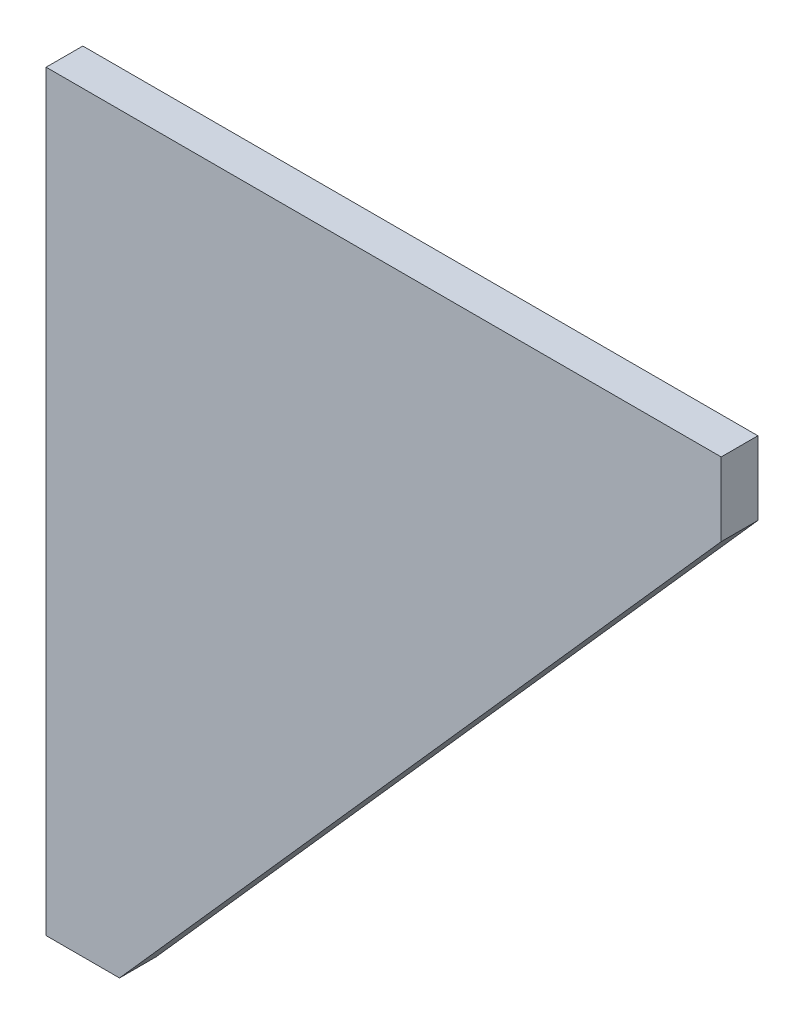
ISO-10303-21;
HEADER;
FILE_DESCRIPTION(('STEP AP214'),'2;1');
FILE_NAME('part.step','',(''),(''),'','','');
FILE_SCHEMA(('AUTOMOTIVE_DESIGN { 1 0 10303 214 1 1 1 1 }'));
ENDSEC;
DATA;
#1=APPLICATION_CONTEXT('core data for automotive mechanical design processes');
#2=APPLICATION_PROTOCOL_DEFINITION('international standard','automotive_design',2000,#1);
#3=PRODUCT_CONTEXT('',#1,'mechanical');
#4=PRODUCT('Part','Part','',(#3));
#5=PRODUCT_RELATED_PRODUCT_CATEGORY('part','',(#4));
#6=PRODUCT_DEFINITION_FORMATION('','',#4);
#7=PRODUCT_DEFINITION_CONTEXT('part definition',#1,'design');
#8=PRODUCT_DEFINITION('design','',#6,#7);
#9=PRODUCT_DEFINITION_SHAPE('','',#8);
#10=(LENGTH_UNIT() NAMED_UNIT(*) SI_UNIT(.MILLI.,.METRE.));
#11=(NAMED_UNIT(*) PLANE_ANGLE_UNIT() SI_UNIT($,.RADIAN.));
#12=(NAMED_UNIT(*) SI_UNIT($,.STERADIAN.) SOLID_ANGLE_UNIT());
#13=UNCERTAINTY_MEASURE_WITH_UNIT(LENGTH_MEASURE(1.E-05),#10,'distance_accuracy_value','');
#14=(GEOMETRIC_REPRESENTATION_CONTEXT(3) GLOBAL_UNCERTAINTY_ASSIGNED_CONTEXT((#13)) GLOBAL_UNIT_ASSIGNED_CONTEXT((#10,
#11,#12)) REPRESENTATION_CONTEXT('',''));
#15=CARTESIAN_POINT('',(0.,0.,0.));
#16=DIRECTION('',(0.,0.,1.));
#17=DIRECTION('',(1.,0.,0.));
#18=AXIS2_PLACEMENT_3D('',#15,#16,#17);
#19=CARTESIAN_POINT('',(92.,-10.,2.5));
#20=DIRECTION('',(-0.748301305404949,0.663358995061685,0.));
#21=DIRECTION('',(0.663358995061685,0.748301305404949,0.));
#22=AXIS2_PLACEMENT_3D('',#19,#20,#21);
#23=PLANE('',#22);
#24=DIRECTION('',(0.,0.,1.));
#25=VECTOR('',#24,1.);
#26=CARTESIAN_POINT('',(10.,-102.5,2.5));
#27=LINE('',#26,#25);
#28=CARTESIAN_POINT('',(10.,-102.5,-2.5));
#29=VERTEX_POINT('',#28);
#30=CARTESIAN_POINT('',(10.,-102.5,2.5));
#31=VERTEX_POINT('',#30);
#32=EDGE_CURVE('E11',#29,#31,#27,.T.);
#33=ORIENTED_EDGE('',*,*,#32,.F.);
#34=DIRECTION('',(0.663358995061685,0.748301305404949,0.));
#35=VECTOR('',#34,1.);
#36=CARTESIAN_POINT('',(92.,-10.,-2.5));
#37=LINE('',#36,#35);
#38=CARTESIAN_POINT('',(92.,-10.,-2.5));
#39=VERTEX_POINT('',#38);
#40=EDGE_CURVE('E94',#29,#39,#37,.T.);
#41=ORIENTED_EDGE('',*,*,#40,.T.);
#42=DIRECTION('',(0.,0.,1.));
#43=VECTOR('',#42,1.);
#44=CARTESIAN_POINT('',(92.,-10.,2.5));
#45=LINE('',#44,#43);
#46=CARTESIAN_POINT('',(92.,-10.,2.5));
#47=VERTEX_POINT('',#46);
#48=EDGE_CURVE('E46',#39,#47,#45,.T.);
#49=ORIENTED_EDGE('',*,*,#48,.T.);
#50=DIRECTION('',(0.663358995061685,0.748301305404949,0.));
#51=VECTOR('',#50,1.);
#52=CARTESIAN_POINT('',(92.,-10.,2.5));
#53=LINE('',#52,#51);
#54=EDGE_CURVE('E114',#31,#47,#53,.T.);
#55=ORIENTED_EDGE('',*,*,#54,.F.);
#56=EDGE_LOOP('',(#33,#41,#49,#55));
#57=FACE_BOUND('',#56,.T.);
#58=ADVANCED_FACE('F36',(#57),#23,.F.);
#59=CARTESIAN_POINT('',(92.,0.,2.5));
#60=DIRECTION('',(-1.,0.,0.));
#61=DIRECTION('',(0.,1.,0.));
#62=AXIS2_PLACEMENT_3D('',#59,#60,#61);
#63=PLANE('',#62);
#64=ORIENTED_EDGE('',*,*,#48,.F.);
#65=DIRECTION('',(0.,1.,0.));
#66=VECTOR('',#65,1.);
#67=CARTESIAN_POINT('',(92.,0.,-2.5));
#68=LINE('',#67,#66);
#69=CARTESIAN_POINT('',(92.,0.,-2.5));
#70=VERTEX_POINT('',#69);
#71=EDGE_CURVE('E104',#39,#70,#68,.T.);
#72=ORIENTED_EDGE('',*,*,#71,.T.);
#73=DIRECTION('',(0.,0.,1.));
#74=VECTOR('',#73,1.);
#75=CARTESIAN_POINT('',(92.,0.,2.5));
#76=LINE('',#75,#74);
#77=CARTESIAN_POINT('',(92.,0.,2.5));
#78=VERTEX_POINT('',#77);
#79=EDGE_CURVE('E109',#70,#78,#76,.T.);
#80=ORIENTED_EDGE('',*,*,#79,.T.);
#81=DIRECTION('',(0.,1.,0.));
#82=VECTOR('',#81,1.);
#83=CARTESIAN_POINT('',(92.,0.,2.5));
#84=LINE('',#83,#82);
#85=EDGE_CURVE('E121',#47,#78,#84,.T.);
#86=ORIENTED_EDGE('',*,*,#85,.F.);
#87=EDGE_LOOP('',(#64,#72,#80,#86));
#88=FACE_BOUND('',#87,.T.);
#89=ADVANCED_FACE('F123',(#88),#63,.F.);
#90=CARTESIAN_POINT('',(0.,0.,2.5));
#91=DIRECTION('',(0.,-1.,0.));
#92=DIRECTION('',(-1.,0.,0.));
#93=AXIS2_PLACEMENT_3D('',#90,#91,#92);
#94=PLANE('',#93);
#95=ORIENTED_EDGE('',*,*,#79,.F.);
#96=DIRECTION('',(-1.,0.,0.));
#97=VECTOR('',#96,1.);
#98=CARTESIAN_POINT('',(0.,0.,-2.5));
#99=LINE('',#98,#97);
#100=CARTESIAN_POINT('',(0.,0.,-2.5));
#101=VERTEX_POINT('',#100);
#102=EDGE_CURVE('E101',#70,#101,#99,.T.);
#103=ORIENTED_EDGE('',*,*,#102,.T.);
#104=DIRECTION('',(0.,0.,1.));
#105=VECTOR('',#104,1.);
#106=CARTESIAN_POINT('',(0.,0.,2.5));
#107=LINE('',#106,#105);
#108=CARTESIAN_POINT('',(0.,0.,2.5));
#109=VERTEX_POINT('',#108);
#110=EDGE_CURVE('E54',#101,#109,#107,.T.);
#111=ORIENTED_EDGE('',*,*,#110,.T.);
#112=DIRECTION('',(-1.,0.,0.));
#113=VECTOR('',#112,1.);
#114=CARTESIAN_POINT('',(0.,0.,2.5));
#115=LINE('',#114,#113);
#116=EDGE_CURVE('E87',#78,#109,#115,.T.);
#117=ORIENTED_EDGE('',*,*,#116,.F.);
#118=EDGE_LOOP('',(#95,#103,#111,#117));
#119=FACE_BOUND('',#118,.T.);
#120=ADVANCED_FACE('F128',(#119),#94,.F.);
#121=CARTESIAN_POINT('',(0.,-102.5,2.5));
#122=DIRECTION('',(1.,0.,0.));
#123=DIRECTION('',(0.,-1.,0.));
#124=AXIS2_PLACEMENT_3D('',#121,#122,#123);
#125=PLANE('',#124);
#126=ORIENTED_EDGE('',*,*,#110,.F.);
#127=DIRECTION('',(0.,1.,0.));
#128=VECTOR('',#127,1.);
#129=CARTESIAN_POINT('',(0.,0.,-2.5));
#130=LINE('',#129,#128);
#131=CARTESIAN_POINT('',(0.,-102.5,-2.5));
#132=VERTEX_POINT('',#131);
#133=EDGE_CURVE('E92',#101,#132,#130,.F.);
#134=ORIENTED_EDGE('',*,*,#133,.T.);
#135=DIRECTION('',(0.,0.,1.));
#136=VECTOR('',#135,1.);
#137=CARTESIAN_POINT('',(0.,-102.5,2.5));
#138=LINE('',#137,#136);
#139=CARTESIAN_POINT('',(0.,-102.5,2.5));
#140=VERTEX_POINT('',#139);
#141=EDGE_CURVE('E40',#132,#140,#138,.T.);
#142=ORIENTED_EDGE('',*,*,#141,.T.);
#143=DIRECTION('',(0.,-1.,0.));
#144=VECTOR('',#143,1.);
#145=CARTESIAN_POINT('',(0.,-102.5,2.5));
#146=LINE('',#145,#144);
#147=EDGE_CURVE('E103',#109,#140,#146,.T.);
#148=ORIENTED_EDGE('',*,*,#147,.F.);
#149=EDGE_LOOP('',(#126,#134,#142,#148));
#150=FACE_BOUND('',#149,.T.);
#151=ADVANCED_FACE('F96',(#150),#125,.F.);
#152=CARTESIAN_POINT('',(10.,-102.5,2.5));
#153=DIRECTION('',(0.,1.,0.));
#154=DIRECTION('',(1.,0.,0.));
#155=AXIS2_PLACEMENT_3D('',#152,#153,#154);
#156=PLANE('',#155);
#157=DIRECTION('',(-1.,0.,0.));
#158=VECTOR('',#157,1.);
#159=CARTESIAN_POINT('',(0.,-102.5,-2.5));
#160=LINE('',#159,#158);
#161=EDGE_CURVE('E81',#132,#29,#160,.F.);
#162=ORIENTED_EDGE('',*,*,#161,.T.);
#163=ORIENTED_EDGE('',*,*,#32,.T.);
#164=DIRECTION('',(1.,0.,0.));
#165=VECTOR('',#164,1.);
#166=CARTESIAN_POINT('',(10.,-102.5,2.5));
#167=LINE('',#166,#165);
#168=EDGE_CURVE('E83',#140,#31,#167,.T.);
#169=ORIENTED_EDGE('',*,*,#168,.F.);
#170=ORIENTED_EDGE('',*,*,#141,.F.);
#171=EDGE_LOOP('',(#162,#163,#169,#170));
#172=FACE_BOUND('',#171,.T.);
#173=ADVANCED_FACE('F38',(#172),#156,.F.);
#174=CARTESIAN_POINT('',(0.,0.,2.5));
#175=DIRECTION('',(0.,0.,-1.));
#176=DIRECTION('',(-1.,0.,0.));
#177=AXIS2_PLACEMENT_3D('',#174,#175,#176);
#178=PLANE('',#177);
#179=ORIENTED_EDGE('',*,*,#147,.T.);
#180=ORIENTED_EDGE('',*,*,#168,.T.);
#181=ORIENTED_EDGE('',*,*,#54,.T.);
#182=ORIENTED_EDGE('',*,*,#85,.T.);
#183=ORIENTED_EDGE('',*,*,#116,.T.);
#184=EDGE_LOOP('',(#179,#180,#181,#182,#183));
#185=FACE_BOUND('',#184,.T.);
#186=ADVANCED_FACE('F119',(#185),#178,.F.);
#187=CARTESIAN_POINT('',(0.,0.,-2.5));
#188=DIRECTION('',(0.,0.,-1.));
#189=DIRECTION('',(-1.,0.,0.));
#190=AXIS2_PLACEMENT_3D('',#187,#188,#189);
#191=PLANE('',#190);
#192=ORIENTED_EDGE('',*,*,#133,.F.);
#193=ORIENTED_EDGE('',*,*,#102,.F.);
#194=ORIENTED_EDGE('',*,*,#71,.F.);
#195=ORIENTED_EDGE('',*,*,#40,.F.);
#196=ORIENTED_EDGE('',*,*,#161,.F.);
#197=EDGE_LOOP('',(#192,#193,#194,#195,#196));
#198=FACE_BOUND('',#197,.T.);
#199=ADVANCED_FACE('F90',(#198),#191,.T.);
#200=CLOSED_SHELL('',(#58,#89,#120,#151,#173,#186,#199));
#201=MANIFOLD_SOLID_BREP('B2',#200);
#202=ADVANCED_BREP_SHAPE_REPRESENTATION('',(#18,#201),#14);
#203=SHAPE_DEFINITION_REPRESENTATION(#9,#202);
ENDSEC;
END-ISO-10303-21;
